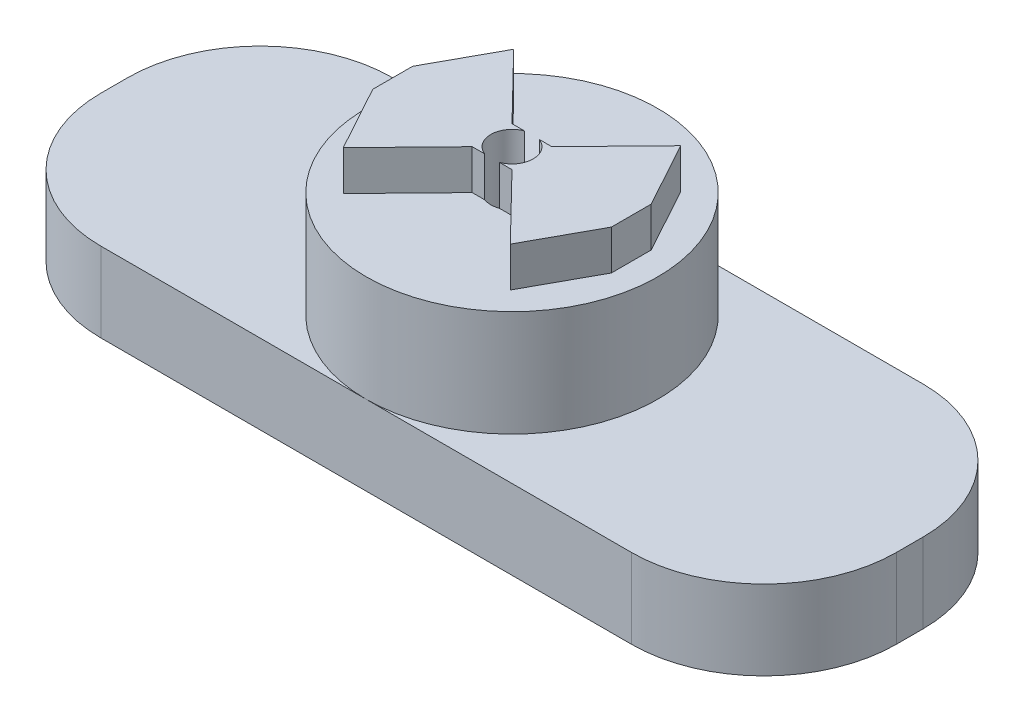
ISO-10303-21;
HEADER;
FILE_DESCRIPTION(('STEP AP214'),'2;1');
FILE_NAME('part.step','',(''),(''),'','','');
FILE_SCHEMA(('AUTOMOTIVE_DESIGN { 1 0 10303 214 1 1 1 1 }'));
ENDSEC;
DATA;
#1=APPLICATION_CONTEXT('core data for automotive mechanical design processes');
#2=APPLICATION_PROTOCOL_DEFINITION('international standard','automotive_design',2000,#1);
#3=PRODUCT_CONTEXT('',#1,'mechanical');
#4=PRODUCT('Part','Part','',(#3));
#5=PRODUCT_RELATED_PRODUCT_CATEGORY('part','',(#4));
#6=PRODUCT_DEFINITION_FORMATION('','',#4);
#7=PRODUCT_DEFINITION_CONTEXT('part definition',#1,'design');
#8=PRODUCT_DEFINITION('design','',#6,#7);
#9=PRODUCT_DEFINITION_SHAPE('','',#8);
#10=(LENGTH_UNIT() NAMED_UNIT(*) SI_UNIT(.MILLI.,.METRE.));
#11=(NAMED_UNIT(*) PLANE_ANGLE_UNIT() SI_UNIT($,.RADIAN.));
#12=(NAMED_UNIT(*) SI_UNIT($,.STERADIAN.) SOLID_ANGLE_UNIT());
#13=UNCERTAINTY_MEASURE_WITH_UNIT(LENGTH_MEASURE(1.E-05),#10,'distance_accuracy_value','');
#14=(GEOMETRIC_REPRESENTATION_CONTEXT(3) GLOBAL_UNCERTAINTY_ASSIGNED_CONTEXT((#13)) GLOBAL_UNIT_ASSIGNED_CONTEXT((#10,
#11,#12)) REPRESENTATION_CONTEXT('',''));
#15=CARTESIAN_POINT('',(0.,0.,0.));
#16=DIRECTION('',(0.,0.,1.));
#17=DIRECTION('',(1.,0.,0.));
#18=AXIS2_PLACEMENT_3D('',#15,#16,#17);
#19=CARTESIAN_POINT('',(1.5,17.,-1.5));
#20=DIRECTION('',(0.,0.,1.));
#21=DIRECTION('',(1.,0.,0.));
#22=AXIS2_PLACEMENT_3D('',#19,#20,#21);
#23=PLANE('',#22);
#24=DIRECTION('',(-1.,0.,0.));
#25=VECTOR('',#24,1.);
#26=CARTESIAN_POINT('',(1.5,17.,-1.5));
#27=LINE('',#26,#25);
#28=CARTESIAN_POINT('',(-0.556776436282992,17.,-1.5));
#29=VERTEX_POINT('',#28);
#30=CARTESIAN_POINT('',(-1.5,17.,-1.5));
#31=VERTEX_POINT('',#30);
#32=EDGE_CURVE('E373',#29,#31,#27,.T.);
#33=ORIENTED_EDGE('',*,*,#32,.F.);
#34=DIRECTION('',(0.,-1.,0.));
#35=VECTOR('',#34,1.);
#36=CARTESIAN_POINT('',(-0.556776436282994,4.,-1.5));
#37=LINE('',#36,#35);
#38=CARTESIAN_POINT('',(-0.556776436282994,14.,-1.5));
#39=VERTEX_POINT('',#38);
#40=EDGE_CURVE('E71',#29,#39,#37,.T.);
#41=ORIENTED_EDGE('',*,*,#40,.T.);
#42=DIRECTION('',(-1.,0.,0.));
#43=VECTOR('',#42,1.);
#44=CARTESIAN_POINT('',(1.5,14.,-1.5));
#45=LINE('',#44,#43);
#46=CARTESIAN_POINT('',(-1.5,14.,-1.5));
#47=VERTEX_POINT('',#46);
#48=EDGE_CURVE('E367',#39,#47,#45,.T.);
#49=ORIENTED_EDGE('',*,*,#48,.T.);
#50=DIRECTION('',(0.,-1.,0.));
#51=VECTOR('',#50,1.);
#52=CARTESIAN_POINT('',(-1.5,17.,-1.5));
#53=LINE('',#52,#51);
#54=EDGE_CURVE('E501',#31,#47,#53,.T.);
#55=ORIENTED_EDGE('',*,*,#54,.F.);
#56=EDGE_LOOP('',(#33,#41,#49,#55));
#57=FACE_BOUND('',#56,.T.);
#58=ADVANCED_FACE('F44',(#57),#23,.F.);
#59=CARTESIAN_POINT('',(-1.5,17.,1.5));
#60=DIRECTION('',(0.,0.,-1.));
#61=DIRECTION('',(-1.,0.,0.));
#62=AXIS2_PLACEMENT_3D('',#59,#60,#61);
#63=PLANE('',#62);
#64=DIRECTION('',(1.,0.,0.));
#65=VECTOR('',#64,1.);
#66=CARTESIAN_POINT('',(-1.5,17.,1.5));
#67=LINE('',#66,#65);
#68=CARTESIAN_POINT('',(0.556776436282994,17.,1.5));
#69=VERTEX_POINT('',#68);
#70=CARTESIAN_POINT('',(1.5,17.,1.5));
#71=VERTEX_POINT('',#70);
#72=EDGE_CURVE('E388',#69,#71,#67,.T.);
#73=ORIENTED_EDGE('',*,*,#72,.F.);
#74=DIRECTION('',(0.,-1.,0.));
#75=VECTOR('',#74,1.);
#76=CARTESIAN_POINT('',(0.556776436282996,4.,1.5));
#77=LINE('',#76,#75);
#78=CARTESIAN_POINT('',(0.556776436282996,14.,1.5));
#79=VERTEX_POINT('',#78);
#80=EDGE_CURVE('E357',#69,#79,#77,.T.);
#81=ORIENTED_EDGE('',*,*,#80,.T.);
#82=DIRECTION('',(1.,0.,0.));
#83=VECTOR('',#82,1.);
#84=CARTESIAN_POINT('',(-1.5,14.,1.5));
#85=LINE('',#84,#83);
#86=CARTESIAN_POINT('',(1.5,14.,1.5));
#87=VERTEX_POINT('',#86);
#88=EDGE_CURVE('E433',#79,#87,#85,.T.);
#89=ORIENTED_EDGE('',*,*,#88,.T.);
#90=DIRECTION('',(0.,-1.,0.));
#91=VECTOR('',#90,1.);
#92=CARTESIAN_POINT('',(1.5,17.,1.5));
#93=LINE('',#92,#91);
#94=EDGE_CURVE('E477',#71,#87,#93,.T.);
#95=ORIENTED_EDGE('',*,*,#94,.F.);
#96=EDGE_LOOP('',(#73,#81,#89,#95));
#97=FACE_BOUND('',#96,.T.);
#98=ADVANCED_FACE('F704',(#97),#63,.F.);
#99=CARTESIAN_POINT('',(0.,17.,0.));
#100=DIRECTION('',(0.,1.,0.));
#101=DIRECTION('',(0.,0.,1.));
#102=AXIS2_PLACEMENT_3D('',#99,#100,#101);
#103=PLANE('',#102);
#104=CARTESIAN_POINT('',(1.5,17.,-1.5));
#105=VERTEX_POINT('',#104);
#106=CARTESIAN_POINT('',(0.556776436282992,17.,-1.5));
#107=VERTEX_POINT('',#106);
#108=EDGE_CURVE('E368',#105,#107,#27,.T.);
#109=ORIENTED_EDGE('',*,*,#108,.T.);
#110=CARTESIAN_POINT('',(0.,17.,0.));
#111=DIRECTION('',(0.,-1.,0.));
#112=DIRECTION('',(0.,0.,-1.));
#113=AXIS2_PLACEMENT_3D('',#110,#111,#112);
#114=CIRCLE('',#113,1.6);
#115=EDGE_CURVE('E56',#107,#69,#114,.T.);
#116=ORIENTED_EDGE('',*,*,#115,.T.);
#117=ORIENTED_EDGE('',*,*,#72,.T.);
#118=DIRECTION('',(0.697851646705174,0.,0.716242332727462));
#119=VECTOR('',#118,1.);
#120=CARTESIAN_POINT('',(1.5,17.,1.5));
#121=LINE('',#120,#119);
#122=CARTESIAN_POINT('',(6.30039359887258,17.,6.42689975799261));
#123=VERTEX_POINT('',#122);
#124=EDGE_CURVE('E393',#71,#123,#121,.T.);
#125=ORIENTED_EDGE('',*,*,#124,.T.);
#126=DIRECTION('',(0.480525794873226,0.,-0.876980592978804));
#127=VECTOR('',#126,1.);
#128=CARTESIAN_POINT('',(6.30039359887258,17.,6.42689975799261));
#129=LINE('',#128,#127);
#130=CARTESIAN_POINT('',(9.,17.,1.5));
#131=VERTEX_POINT('',#130);
#132=EDGE_CURVE('E396',#123,#131,#129,.T.);
#133=ORIENTED_EDGE('',*,*,#132,.T.);
#134=DIRECTION('',(0.,0.,-1.));
#135=VECTOR('',#134,1.);
#136=CARTESIAN_POINT('',(9.,17.,1.5));
#137=LINE('',#136,#135);
#138=CARTESIAN_POINT('',(9.,17.,-1.5));
#139=VERTEX_POINT('',#138);
#140=EDGE_CURVE('E399',#131,#139,#137,.T.);
#141=ORIENTED_EDGE('',*,*,#140,.T.);
#142=DIRECTION('',(-0.480525794873226,0.,-0.876980592978804));
#143=VECTOR('',#142,1.);
#144=CARTESIAN_POINT('',(9.,17.,-1.5));
#145=LINE('',#144,#143);
#146=CARTESIAN_POINT('',(6.30039359887258,17.,-6.42689975799261));
#147=VERTEX_POINT('',#146);
#148=EDGE_CURVE('E402',#139,#147,#145,.T.);
#149=ORIENTED_EDGE('',*,*,#148,.T.);
#150=DIRECTION('',(-0.697851646705175,0.,0.716242332727462));
#151=VECTOR('',#150,1.);
#152=CARTESIAN_POINT('',(6.30039359887258,17.,-6.42689975799261));
#153=LINE('',#152,#151);
#154=EDGE_CURVE('E405',#147,#105,#153,.T.);
#155=ORIENTED_EDGE('',*,*,#154,.T.);
#156=EDGE_LOOP('',(#109,#116,#117,#125,#133,#141,#149,#155));
#157=FACE_BOUND('',#156,.T.);
#158=ADVANCED_FACE('F710',(#157),#103,.T.);
#159=CARTESIAN_POINT('',(-1.5,17.,1.5));
#160=VERTEX_POINT('',#159);
#161=CARTESIAN_POINT('',(-0.556776436282994,17.,1.5));
#162=VERTEX_POINT('',#161);
#163=EDGE_CURVE('E389',#160,#162,#67,.T.);
#164=ORIENTED_EDGE('',*,*,#163,.T.);
#165=EDGE_CURVE('E11',#162,#29,#114,.T.);
#166=ORIENTED_EDGE('',*,*,#165,.T.);
#167=ORIENTED_EDGE('',*,*,#32,.T.);
#168=DIRECTION('',(-0.697851646705174,0.,-0.716242332727462));
#169=VECTOR('',#168,1.);
#170=CARTESIAN_POINT('',(-1.5,17.,-1.5));
#171=LINE('',#170,#169);
#172=CARTESIAN_POINT('',(-6.30039359887257,17.,-6.42689975799261));
#173=VERTEX_POINT('',#172);
#174=EDGE_CURVE('E372',#31,#173,#171,.T.);
#175=ORIENTED_EDGE('',*,*,#174,.T.);
#176=DIRECTION('',(-0.480525794873226,0.,0.876980592978804));
#177=VECTOR('',#176,1.);
#178=CARTESIAN_POINT('',(-6.30039359887257,17.,-6.42689975799261));
#179=LINE('',#178,#177);
#180=CARTESIAN_POINT('',(-9.,17.,-1.5));
#181=VERTEX_POINT('',#180);
#182=EDGE_CURVE('E376',#173,#181,#179,.T.);
#183=ORIENTED_EDGE('',*,*,#182,.T.);
#184=DIRECTION('',(0.,0.,1.));
#185=VECTOR('',#184,1.);
#186=CARTESIAN_POINT('',(-9.,17.,-1.5));
#187=LINE('',#186,#185);
#188=CARTESIAN_POINT('',(-9.,17.,1.5));
#189=VERTEX_POINT('',#188);
#190=EDGE_CURVE('E379',#181,#189,#187,.T.);
#191=ORIENTED_EDGE('',*,*,#190,.T.);
#192=DIRECTION('',(0.480525794873226,0.,0.876980592978804));
#193=VECTOR('',#192,1.);
#194=CARTESIAN_POINT('',(-9.,17.,1.5));
#195=LINE('',#194,#193);
#196=CARTESIAN_POINT('',(-6.30039359887257,17.,6.42689975799261));
#197=VERTEX_POINT('',#196);
#198=EDGE_CURVE('E382',#189,#197,#195,.T.);
#199=ORIENTED_EDGE('',*,*,#198,.T.);
#200=DIRECTION('',(0.697851646705174,0.,-0.716242332727462));
#201=VECTOR('',#200,1.);
#202=CARTESIAN_POINT('',(-6.30039359887257,17.,6.42689975799261));
#203=LINE('',#202,#201);
#204=EDGE_CURVE('E385',#197,#160,#203,.T.);
#205=ORIENTED_EDGE('',*,*,#204,.T.);
#206=EDGE_LOOP('',(#164,#166,#167,#175,#183,#191,#199,#205));
#207=FACE_BOUND('',#206,.T.);
#208=ADVANCED_FACE('F673',(#207),#103,.T.);
#209=CARTESIAN_POINT('',(-20.01,6.,1.01));
#210=DIRECTION('',(0.,-1.,0.));
#211=DIRECTION('',(0.,0.,-1.));
#212=AXIS2_PLACEMENT_3D('',#209,#210,#211);
#213=PLANE('',#212);
#214=CARTESIAN_POINT('',(0.,6.,0.));
#215=DIRECTION('',(0.,1.,0.));
#216=DIRECTION('',(0.,0.,1.));
#217=AXIS2_PLACEMENT_3D('',#214,#215,#216);
#218=CIRCLE('',#217,11.);
#219=CARTESIAN_POINT('',(0.,6.,11.));
#220=VERTEX_POINT('',#219);
#221=CARTESIAN_POINT('',(0.,6.,-11.));
#222=VERTEX_POINT('',#221);
#223=EDGE_CURVE('E510',#220,#222,#218,.T.);
#224=ORIENTED_EDGE('',*,*,#223,.F.);
#225=DIRECTION('',(1.,0.,0.));
#226=VECTOR('',#225,1.);
#227=CARTESIAN_POINT('',(-20.01,6.,11.));
#228=LINE('',#227,#226);
#229=CARTESIAN_POINT('',(20.01,6.,11.));
#230=VERTEX_POINT('',#229);
#231=EDGE_CURVE('E526',#220,#230,#228,.T.);
#232=ORIENTED_EDGE('',*,*,#231,.T.);
#233=CARTESIAN_POINT('',(20.01,6.,1.01));
#234=DIRECTION('',(0.,1.,0.));
#235=DIRECTION('',(0.,0.,1.));
#236=AXIS2_PLACEMENT_3D('',#233,#234,#235);
#237=CIRCLE('',#236,9.99);
#238=CARTESIAN_POINT('',(30.,6.,1.01));
#239=VERTEX_POINT('',#238);
#240=EDGE_CURVE('E531',#230,#239,#237,.T.);
#241=ORIENTED_EDGE('',*,*,#240,.T.);
#242=DIRECTION('',(0.,0.,-1.));
#243=VECTOR('',#242,1.);
#244=CARTESIAN_POINT('',(30.,6.,1.01));
#245=LINE('',#244,#243);
#246=CARTESIAN_POINT('',(30.,6.,-1.01));
#247=VERTEX_POINT('',#246);
#248=EDGE_CURVE('E534',#239,#247,#245,.T.);
#249=ORIENTED_EDGE('',*,*,#248,.T.);
#250=CARTESIAN_POINT('',(20.01,6.,-1.01));
#251=DIRECTION('',(0.,1.,0.));
#252=DIRECTION('',(0.,0.,-1.));
#253=AXIS2_PLACEMENT_3D('',#250,#251,#252);
#254=CIRCLE('',#253,9.99);
#255=CARTESIAN_POINT('',(20.01,6.,-11.));
#256=VERTEX_POINT('',#255);
#257=EDGE_CURVE('E537',#247,#256,#254,.T.);
#258=ORIENTED_EDGE('',*,*,#257,.T.);
#259=DIRECTION('',(-1.,0.,0.));
#260=VECTOR('',#259,1.);
#261=CARTESIAN_POINT('',(-20.01,6.,-11.));
#262=LINE('',#261,#260);
#263=EDGE_CURVE('E541',#256,#222,#262,.T.);
#264=ORIENTED_EDGE('',*,*,#263,.T.);
#265=EDGE_LOOP('',(#224,#232,#241,#249,#258,#264));
#266=FACE_BOUND('',#265,.T.);
#267=ADVANCED_FACE('F624',(#266),#213,.F.);
#268=CARTESIAN_POINT('',(-20.01,6.,1.01));
#269=DIRECTION('',(0.,-1.,0.));
#270=DIRECTION('',(0.,0.,-1.));
#271=AXIS2_PLACEMENT_3D('',#268,#269,#270);
#272=CYLINDRICAL_SURFACE('',#271,9.99);
#273=CARTESIAN_POINT('',(-20.01,0.,1.01));
#274=DIRECTION('',(0.,1.,0.));
#275=DIRECTION('',(0.,0.,-1.));
#276=AXIS2_PLACEMENT_3D('',#273,#274,#275);
#277=CIRCLE('',#276,9.99);
#278=CARTESIAN_POINT('',(-30.,0.,1.01));
#279=VERTEX_POINT('',#278);
#280=CARTESIAN_POINT('',(-20.01,0.,11.));
#281=VERTEX_POINT('',#280);
#282=EDGE_CURVE('E518',#279,#281,#277,.T.);
#283=ORIENTED_EDGE('',*,*,#282,.T.);
#284=DIRECTION('',(0.,-1.,0.));
#285=VECTOR('',#284,1.);
#286=CARTESIAN_POINT('',(-20.01,6.,11.));
#287=LINE('',#286,#285);
#288=CARTESIAN_POINT('',(-20.01,6.,11.));
#289=VERTEX_POINT('',#288);
#290=EDGE_CURVE('E48',#289,#281,#287,.T.);
#291=ORIENTED_EDGE('',*,*,#290,.F.);
#292=CARTESIAN_POINT('',(-20.01,6.,1.01));
#293=DIRECTION('',(0.,1.,0.));
#294=DIRECTION('',(0.,0.,-1.));
#295=AXIS2_PLACEMENT_3D('',#292,#293,#294);
#296=CIRCLE('',#295,9.99);
#297=CARTESIAN_POINT('',(-30.,6.,1.01));
#298=VERTEX_POINT('',#297);
#299=EDGE_CURVE('E522',#298,#289,#296,.T.);
#300=ORIENTED_EDGE('',*,*,#299,.F.);
#301=DIRECTION('',(0.,-1.,0.));
#302=VECTOR('',#301,1.);
#303=CARTESIAN_POINT('',(-30.,6.,1.01));
#304=LINE('',#303,#302);
#305=EDGE_CURVE('E551',#298,#279,#304,.T.);
#306=ORIENTED_EDGE('',*,*,#305,.T.);
#307=EDGE_LOOP('',(#283,#291,#300,#306));
#308=FACE_BOUND('',#307,.T.);
#309=ADVANCED_FACE('F46',(#308),#272,.T.);
#310=CARTESIAN_POINT('',(-20.01,6.,11.));
#311=DIRECTION('',(0.,0.,-1.));
#312=DIRECTION('',(-1.,0.,0.));
#313=AXIS2_PLACEMENT_3D('',#310,#311,#312);
#314=PLANE('',#313);
#315=DIRECTION('',(1.,0.,0.));
#316=VECTOR('',#315,1.);
#317=CARTESIAN_POINT('',(-20.01,0.,11.));
#318=LINE('',#317,#316);
#319=CARTESIAN_POINT('',(20.01,0.,11.));
#320=VERTEX_POINT('',#319);
#321=EDGE_CURVE('E555',#281,#320,#318,.T.);
#322=ORIENTED_EDGE('',*,*,#321,.T.);
#323=DIRECTION('',(0.,-1.,0.));
#324=VECTOR('',#323,1.);
#325=CARTESIAN_POINT('',(20.01,6.,11.));
#326=LINE('',#325,#324);
#327=EDGE_CURVE('E597',#230,#320,#326,.T.);
#328=ORIENTED_EDGE('',*,*,#327,.F.);
#329=ORIENTED_EDGE('',*,*,#231,.F.);
#330=EDGE_CURVE('E528',#289,#220,#228,.T.);
#331=ORIENTED_EDGE('',*,*,#330,.F.);
#332=ORIENTED_EDGE('',*,*,#290,.T.);
#333=EDGE_LOOP('',(#322,#328,#329,#331,#332));
#334=FACE_BOUND('',#333,.T.);
#335=ADVANCED_FACE('F648',(#334),#314,.F.);
#336=CARTESIAN_POINT('',(20.01,6.,1.01));
#337=DIRECTION('',(0.,-1.,0.));
#338=DIRECTION('',(0.,0.,-1.));
#339=AXIS2_PLACEMENT_3D('',#336,#337,#338);
#340=CYLINDRICAL_SURFACE('',#339,9.99);
#341=CARTESIAN_POINT('',(20.01,0.,1.01));
#342=DIRECTION('',(0.,1.,0.));
#343=DIRECTION('',(0.,0.,1.));
#344=AXIS2_PLACEMENT_3D('',#341,#342,#343);
#345=CIRCLE('',#344,9.99);
#346=CARTESIAN_POINT('',(30.,0.,1.01));
#347=VERTEX_POINT('',#346);
#348=EDGE_CURVE('E558',#320,#347,#345,.T.);
#349=ORIENTED_EDGE('',*,*,#348,.T.);
#350=DIRECTION('',(0.,-1.,0.));
#351=VECTOR('',#350,1.);
#352=CARTESIAN_POINT('',(30.,6.,1.01));
#353=LINE('',#352,#351);
#354=EDGE_CURVE('E594',#239,#347,#353,.T.);
#355=ORIENTED_EDGE('',*,*,#354,.F.);
#356=ORIENTED_EDGE('',*,*,#240,.F.);
#357=ORIENTED_EDGE('',*,*,#327,.T.);
#358=EDGE_LOOP('',(#349,#355,#356,#357));
#359=FACE_BOUND('',#358,.T.);
#360=ADVANCED_FACE('F650',(#359),#340,.T.);
#361=CARTESIAN_POINT('',(30.,6.,1.01));
#362=DIRECTION('',(-1.,0.,0.));
#363=DIRECTION('',(0.,0.,1.));
#364=AXIS2_PLACEMENT_3D('',#361,#362,#363);
#365=PLANE('',#364);
#366=DIRECTION('',(0.,0.,-1.));
#367=VECTOR('',#366,1.);
#368=CARTESIAN_POINT('',(30.,0.,1.01));
#369=LINE('',#368,#367);
#370=CARTESIAN_POINT('',(30.,0.,-1.01));
#371=VERTEX_POINT('',#370);
#372=EDGE_CURVE('E561',#347,#371,#369,.T.);
#373=ORIENTED_EDGE('',*,*,#372,.T.);
#374=DIRECTION('',(0.,-1.,0.));
#375=VECTOR('',#374,1.);
#376=CARTESIAN_POINT('',(30.,6.,-1.01));
#377=LINE('',#376,#375);
#378=EDGE_CURVE('E590',#247,#371,#377,.T.);
#379=ORIENTED_EDGE('',*,*,#378,.F.);
#380=ORIENTED_EDGE('',*,*,#248,.F.);
#381=ORIENTED_EDGE('',*,*,#354,.T.);
#382=EDGE_LOOP('',(#373,#379,#380,#381));
#383=FACE_BOUND('',#382,.T.);
#384=ADVANCED_FACE('F952',(#383),#365,.F.);
#385=CARTESIAN_POINT('',(20.01,6.,-1.01));
#386=DIRECTION('',(0.,-1.,0.));
#387=DIRECTION('',(0.,0.,-1.));
#388=AXIS2_PLACEMENT_3D('',#385,#386,#387);
#389=CYLINDRICAL_SURFACE('',#388,9.99);
#390=CARTESIAN_POINT('',(20.01,0.,-1.01));
#391=DIRECTION('',(0.,1.,0.));
#392=DIRECTION('',(0.,0.,-1.));
#393=AXIS2_PLACEMENT_3D('',#390,#391,#392);
#394=CIRCLE('',#393,9.99);
#395=CARTESIAN_POINT('',(20.01,0.,-11.));
#396=VERTEX_POINT('',#395);
#397=EDGE_CURVE('E564',#371,#396,#394,.T.);
#398=ORIENTED_EDGE('',*,*,#397,.T.);
#399=DIRECTION('',(0.,-1.,0.));
#400=VECTOR('',#399,1.);
#401=CARTESIAN_POINT('',(20.01,6.,-11.));
#402=LINE('',#401,#400);
#403=EDGE_CURVE('E586',#256,#396,#402,.T.);
#404=ORIENTED_EDGE('',*,*,#403,.F.);
#405=ORIENTED_EDGE('',*,*,#257,.F.);
#406=ORIENTED_EDGE('',*,*,#378,.T.);
#407=EDGE_LOOP('',(#398,#404,#405,#406));
#408=FACE_BOUND('',#407,.T.);
#409=ADVANCED_FACE('F630',(#408),#389,.T.);
#410=CARTESIAN_POINT('',(-20.01,6.,-11.));
#411=DIRECTION('',(0.,0.,1.));
#412=DIRECTION('',(1.,0.,0.));
#413=AXIS2_PLACEMENT_3D('',#410,#411,#412);
#414=PLANE('',#413);
#415=DIRECTION('',(-1.,0.,0.));
#416=VECTOR('',#415,1.);
#417=CARTESIAN_POINT('',(-20.01,0.,-11.));
#418=LINE('',#417,#416);
#419=CARTESIAN_POINT('',(-20.01,0.,-11.));
#420=VERTEX_POINT('',#419);
#421=EDGE_CURVE('E567',#396,#420,#418,.T.);
#422=ORIENTED_EDGE('',*,*,#421,.T.);
#423=DIRECTION('',(0.,-1.,0.));
#424=VECTOR('',#423,1.);
#425=CARTESIAN_POINT('',(-20.01,6.,-11.));
#426=LINE('',#425,#424);
#427=CARTESIAN_POINT('',(-20.01,6.,-11.));
#428=VERTEX_POINT('',#427);
#429=EDGE_CURVE('E582',#428,#420,#426,.T.);
#430=ORIENTED_EDGE('',*,*,#429,.F.);
#431=EDGE_CURVE('E540',#222,#428,#262,.T.);
#432=ORIENTED_EDGE('',*,*,#431,.F.);
#433=ORIENTED_EDGE('',*,*,#263,.F.);
#434=ORIENTED_EDGE('',*,*,#403,.T.);
#435=EDGE_LOOP('',(#422,#430,#432,#433,#434));
#436=FACE_BOUND('',#435,.T.);
#437=ADVANCED_FACE('F620',(#436),#414,.F.);
#438=CARTESIAN_POINT('',(-20.01,6.,-1.01));
#439=DIRECTION('',(0.,-1.,0.));
#440=DIRECTION('',(0.,0.,-1.));
#441=AXIS2_PLACEMENT_3D('',#438,#439,#440);
#442=CYLINDRICAL_SURFACE('',#441,9.99);
#443=CARTESIAN_POINT('',(-20.01,0.,-1.01));
#444=DIRECTION('',(0.,1.,0.));
#445=DIRECTION('',(0.,0.,-1.));
#446=AXIS2_PLACEMENT_3D('',#443,#444,#445);
#447=CIRCLE('',#446,9.99);
#448=CARTESIAN_POINT('',(-30.,0.,-1.01));
#449=VERTEX_POINT('',#448);
#450=EDGE_CURVE('E570',#420,#449,#447,.T.);
#451=ORIENTED_EDGE('',*,*,#450,.T.);
#452=DIRECTION('',(0.,-1.,0.));
#453=VECTOR('',#452,1.);
#454=CARTESIAN_POINT('',(-30.,6.,-1.01));
#455=LINE('',#454,#453);
#456=CARTESIAN_POINT('',(-30.,6.,-1.01));
#457=VERTEX_POINT('',#456);
#458=EDGE_CURVE('E578',#457,#449,#455,.T.);
#459=ORIENTED_EDGE('',*,*,#458,.F.);
#460=CARTESIAN_POINT('',(-20.01,6.,-1.01));
#461=DIRECTION('',(0.,1.,0.));
#462=DIRECTION('',(0.,0.,-1.));
#463=AXIS2_PLACEMENT_3D('',#460,#461,#462);
#464=CIRCLE('',#463,9.99);
#465=EDGE_CURVE('E545',#428,#457,#464,.T.);
#466=ORIENTED_EDGE('',*,*,#465,.F.);
#467=ORIENTED_EDGE('',*,*,#429,.T.);
#468=EDGE_LOOP('',(#451,#459,#466,#467));
#469=FACE_BOUND('',#468,.T.);
#470=ADVANCED_FACE('F641',(#469),#442,.T.);
#471=CARTESIAN_POINT('',(-30.,6.,1.01));
#472=DIRECTION('',(1.,0.,0.));
#473=DIRECTION('',(0.,0.,-1.));
#474=AXIS2_PLACEMENT_3D('',#471,#472,#473);
#475=PLANE('',#474);
#476=DIRECTION('',(0.,0.,1.));
#477=VECTOR('',#476,1.);
#478=CARTESIAN_POINT('',(-30.,0.,1.01));
#479=LINE('',#478,#477);
#480=EDGE_CURVE('E527',#449,#279,#479,.T.);
#481=ORIENTED_EDGE('',*,*,#480,.T.);
#482=ORIENTED_EDGE('',*,*,#305,.F.);
#483=DIRECTION('',(0.,0.,1.));
#484=VECTOR('',#483,1.);
#485=CARTESIAN_POINT('',(-30.,6.,1.01));
#486=LINE('',#485,#484);
#487=EDGE_CURVE('E548',#457,#298,#486,.T.);
#488=ORIENTED_EDGE('',*,*,#487,.F.);
#489=ORIENTED_EDGE('',*,*,#458,.T.);
#490=EDGE_LOOP('',(#481,#482,#488,#489));
#491=FACE_BOUND('',#490,.T.);
#492=ADVANCED_FACE('F644',(#491),#475,.F.);
#493=EDGE_CURVE('E54',#222,#220,#218,.T.);
#494=ORIENTED_EDGE('',*,*,#493,.F.);
#495=ORIENTED_EDGE('',*,*,#431,.T.);
#496=ORIENTED_EDGE('',*,*,#465,.T.);
#497=ORIENTED_EDGE('',*,*,#487,.T.);
#498=ORIENTED_EDGE('',*,*,#299,.T.);
#499=ORIENTED_EDGE('',*,*,#330,.T.);
#500=EDGE_LOOP('',(#494,#495,#496,#497,#498,#499));
#501=FACE_BOUND('',#500,.T.);
#502=ADVANCED_FACE('F615',(#501),#213,.F.);
#503=CARTESIAN_POINT('',(-20.01,0.,1.01));
#504=DIRECTION('',(0.,-1.,0.));
#505=DIRECTION('',(0.,0.,-1.));
#506=AXIS2_PLACEMENT_3D('',#503,#504,#505);
#507=PLANE('',#506);
#508=DIRECTION('',(1.,0.,0.));
#509=VECTOR('',#508,1.);
#510=CARTESIAN_POINT('',(10.,0.,-2.5));
#511=LINE('',#510,#509);
#512=CARTESIAN_POINT('',(10.,0.,-2.5));
#513=VERTEX_POINT('',#512);
#514=CARTESIAN_POINT('',(20.,0.,-2.5));
#515=VERTEX_POINT('',#514);
#516=EDGE_CURVE('E63',#513,#515,#511,.T.);
#517=ORIENTED_EDGE('',*,*,#516,.F.);
#518=DIRECTION('',(0.,0.,-1.));
#519=VECTOR('',#518,1.);
#520=CARTESIAN_POINT('',(10.,0.,2.5));
#521=LINE('',#520,#519);
#522=CARTESIAN_POINT('',(10.,0.,2.5));
#523=VERTEX_POINT('',#522);
#524=EDGE_CURVE('E280',#523,#513,#521,.T.);
#525=ORIENTED_EDGE('',*,*,#524,.F.);
#526=DIRECTION('',(-1.,0.,0.));
#527=VECTOR('',#526,1.);
#528=CARTESIAN_POINT('',(10.,0.,2.5));
#529=LINE('',#528,#527);
#530=CARTESIAN_POINT('',(20.,0.,2.5));
#531=VERTEX_POINT('',#530);
#532=EDGE_CURVE('E284',#531,#523,#529,.T.);
#533=ORIENTED_EDGE('',*,*,#532,.F.);
#534=DIRECTION('',(0.,0.,-1.));
#535=VECTOR('',#534,1.);
#536=CARTESIAN_POINT('',(20.,0.,2.5));
#537=LINE('',#536,#535);
#538=CARTESIAN_POINT('',(20.,0.,6.));
#539=VERTEX_POINT('',#538);
#540=EDGE_CURVE('E315',#539,#531,#537,.T.);
#541=ORIENTED_EDGE('',*,*,#540,.F.);
#542=DIRECTION('',(-0.707106781186547,0.,0.707106781186548));
#543=VECTOR('',#542,1.);
#544=CARTESIAN_POINT('',(20.,0.,6.));
#545=LINE('',#544,#543);
#546=CARTESIAN_POINT('',(26.,0.,0.));
#547=VERTEX_POINT('',#546);
#548=EDGE_CURVE('E311',#547,#539,#545,.T.);
#549=ORIENTED_EDGE('',*,*,#548,.F.);
#550=DIRECTION('',(0.707106781186548,0.,0.707106781186547));
#551=VECTOR('',#550,1.);
#552=CARTESIAN_POINT('',(26.,0.,0.));
#553=LINE('',#552,#551);
#554=CARTESIAN_POINT('',(20.,0.,-6.));
#555=VERTEX_POINT('',#554);
#556=EDGE_CURVE('E307',#555,#547,#553,.T.);
#557=ORIENTED_EDGE('',*,*,#556,.F.);
#558=DIRECTION('',(0.,0.,-1.));
#559=VECTOR('',#558,1.);
#560=CARTESIAN_POINT('',(20.,0.,-2.5));
#561=LINE('',#560,#559);
#562=EDGE_CURVE('E304',#515,#555,#561,.T.);
#563=ORIENTED_EDGE('',*,*,#562,.F.);
#564=EDGE_LOOP('',(#517,#525,#533,#541,#549,#557,#563));
#565=FACE_BOUND('',#564,.T.);
#566=CARTESIAN_POINT('',(0.,0.,0.));
#567=DIRECTION('',(0.,-1.,0.));
#568=DIRECTION('',(0.,0.,-1.));
#569=AXIS2_PLACEMENT_3D('',#566,#567,#568);
#570=CIRCLE('',#569,6.);
#571=CARTESIAN_POINT('',(0.,0.,-6.));
#572=VERTEX_POINT('',#571);
#573=EDGE_CURVE('E505',#572,#572,#570,.T.);
#574=ORIENTED_EDGE('',*,*,#573,.F.);
#575=EDGE_LOOP('',(#574));
#576=FACE_BOUND('',#575,.T.);
#577=ORIENTED_EDGE('',*,*,#282,.F.);
#578=ORIENTED_EDGE('',*,*,#480,.F.);
#579=ORIENTED_EDGE('',*,*,#450,.F.);
#580=ORIENTED_EDGE('',*,*,#421,.F.);
#581=ORIENTED_EDGE('',*,*,#397,.F.);
#582=ORIENTED_EDGE('',*,*,#372,.F.);
#583=ORIENTED_EDGE('',*,*,#348,.F.);
#584=ORIENTED_EDGE('',*,*,#321,.F.);
#585=EDGE_LOOP('',(#577,#578,#579,#580,#581,#582,#583,#584));
#586=FACE_BOUND('',#585,.T.);
#587=ADVANCED_FACE('F636',(#565,#576,#586),#507,.T.);
#588=CARTESIAN_POINT('',(0.,14.,0.));
#589=DIRECTION('',(0.,-1.,0.));
#590=DIRECTION('',(0.,0.,-1.));
#591=AXIS2_PLACEMENT_3D('',#588,#589,#590);
#592=CYLINDRICAL_SURFACE('',#591,11.);
#593=CARTESIAN_POINT('',(0.,14.,0.));
#594=DIRECTION('',(0.,1.,0.));
#595=DIRECTION('',(0.,0.,1.));
#596=AXIS2_PLACEMENT_3D('',#593,#594,#595);
#597=CIRCLE('',#596,11.);
#598=CARTESIAN_POINT('',(0.,14.,11.));
#599=VERTEX_POINT('',#598);
#600=EDGE_CURVE('E514',#599,#599,#597,.T.);
#601=ORIENTED_EDGE('',*,*,#600,.F.);
#602=EDGE_LOOP('',(#601));
#603=FACE_BOUND('',#602,.T.);
#604=ORIENTED_EDGE('',*,*,#223,.T.);
#605=ORIENTED_EDGE('',*,*,#493,.T.);
#606=EDGE_LOOP('',(#604,#605));
#607=FACE_BOUND('',#606,.T.);
#608=ADVANCED_FACE('F611',(#603,#607),#592,.T.);
#609=CARTESIAN_POINT('',(0.,14.,0.));
#610=DIRECTION('',(0.,1.,0.));
#611=DIRECTION('',(0.,0.,1.));
#612=AXIS2_PLACEMENT_3D('',#609,#610,#611);
#613=PLANE('',#612);
#614=CARTESIAN_POINT('',(0.,14.,0.));
#615=DIRECTION('',(0.,1.,0.));
#616=DIRECTION('',(0.,0.,1.));
#617=AXIS2_PLACEMENT_3D('',#614,#615,#616);
#618=CIRCLE('',#617,1.6);
#619=CARTESIAN_POINT('',(0.556776436282994,14.,-1.5));
#620=VERTEX_POINT('',#619);
#621=EDGE_CURVE('E353',#620,#39,#618,.T.);
#622=ORIENTED_EDGE('',*,*,#621,.F.);
#623=CARTESIAN_POINT('',(1.5,14.,-1.5));
#624=VERTEX_POINT('',#623);
#625=EDGE_CURVE('E409',#624,#620,#45,.T.);
#626=ORIENTED_EDGE('',*,*,#625,.F.);
#627=DIRECTION('',(-0.697851646705175,0.,0.716242332727462));
#628=VECTOR('',#627,1.);
#629=CARTESIAN_POINT('',(6.30039359887258,14.,-6.42689975799261));
#630=LINE('',#629,#628);
#631=CARTESIAN_POINT('',(6.30039359887258,14.,-6.42689975799261));
#632=VERTEX_POINT('',#631);
#633=EDGE_CURVE('E454',#632,#624,#630,.T.);
#634=ORIENTED_EDGE('',*,*,#633,.F.);
#635=DIRECTION('',(-0.480525794873226,0.,-0.876980592978804));
#636=VECTOR('',#635,1.);
#637=CARTESIAN_POINT('',(9.,14.,-1.5));
#638=LINE('',#637,#636);
#639=CARTESIAN_POINT('',(9.,14.,-1.5));
#640=VERTEX_POINT('',#639);
#641=EDGE_CURVE('E450',#640,#632,#638,.T.);
#642=ORIENTED_EDGE('',*,*,#641,.F.);
#643=DIRECTION('',(0.,0.,-1.));
#644=VECTOR('',#643,1.);
#645=CARTESIAN_POINT('',(9.,14.,1.5));
#646=LINE('',#645,#644);
#647=CARTESIAN_POINT('',(9.,14.,1.5));
#648=VERTEX_POINT('',#647);
#649=EDGE_CURVE('E446',#648,#640,#646,.T.);
#650=ORIENTED_EDGE('',*,*,#649,.F.);
#651=DIRECTION('',(0.480525794873226,0.,-0.876980592978804));
#652=VECTOR('',#651,1.);
#653=CARTESIAN_POINT('',(6.30039359887258,14.,6.42689975799261));
#654=LINE('',#653,#652);
#655=CARTESIAN_POINT('',(6.30039359887258,14.,6.42689975799261));
#656=VERTEX_POINT('',#655);
#657=EDGE_CURVE('E442',#656,#648,#654,.T.);
#658=ORIENTED_EDGE('',*,*,#657,.F.);
#659=DIRECTION('',(0.697851646705174,0.,0.716242332727462));
#660=VECTOR('',#659,1.);
#661=CARTESIAN_POINT('',(1.5,14.,1.5));
#662=LINE('',#661,#660);
#663=EDGE_CURVE('E438',#87,#656,#662,.T.);
#664=ORIENTED_EDGE('',*,*,#663,.F.);
#665=ORIENTED_EDGE('',*,*,#88,.F.);
#666=CARTESIAN_POINT('',(-0.556776436282996,14.,1.5));
#667=VERTEX_POINT('',#666);
#668=EDGE_CURVE('E349',#667,#79,#618,.T.);
#669=ORIENTED_EDGE('',*,*,#668,.F.);
#670=CARTESIAN_POINT('',(-1.5,14.,1.5));
#671=VERTEX_POINT('',#670);
#672=EDGE_CURVE('E434',#671,#667,#85,.T.);
#673=ORIENTED_EDGE('',*,*,#672,.F.);
#674=DIRECTION('',(0.697851646705174,0.,-0.716242332727462));
#675=VECTOR('',#674,1.);
#676=CARTESIAN_POINT('',(-6.30039359887257,14.,6.42689975799261));
#677=LINE('',#676,#675);
#678=CARTESIAN_POINT('',(-6.30039359887257,14.,6.42689975799261));
#679=VERTEX_POINT('',#678);
#680=EDGE_CURVE('E429',#679,#671,#677,.T.);
#681=ORIENTED_EDGE('',*,*,#680,.F.);
#682=DIRECTION('',(0.480525794873226,0.,0.876980592978804));
#683=VECTOR('',#682,1.);
#684=CARTESIAN_POINT('',(-9.,14.,1.5));
#685=LINE('',#684,#683);
#686=CARTESIAN_POINT('',(-9.,14.,1.5));
#687=VERTEX_POINT('',#686);
#688=EDGE_CURVE('E425',#687,#679,#685,.T.);
#689=ORIENTED_EDGE('',*,*,#688,.F.);
#690=DIRECTION('',(0.,0.,1.));
#691=VECTOR('',#690,1.);
#692=CARTESIAN_POINT('',(-9.,14.,-1.5));
#693=LINE('',#692,#691);
#694=CARTESIAN_POINT('',(-9.,14.,-1.5));
#695=VERTEX_POINT('',#694);
#696=EDGE_CURVE('E421',#695,#687,#693,.T.);
#697=ORIENTED_EDGE('',*,*,#696,.F.);
#698=DIRECTION('',(-0.480525794873226,0.,0.876980592978804));
#699=VECTOR('',#698,1.);
#700=CARTESIAN_POINT('',(-6.30039359887257,14.,-6.42689975799261));
#701=LINE('',#700,#699);
#702=CARTESIAN_POINT('',(-6.30039359887257,14.,-6.42689975799261));
#703=VERTEX_POINT('',#702);
#704=EDGE_CURVE('E417',#703,#695,#701,.T.);
#705=ORIENTED_EDGE('',*,*,#704,.F.);
#706=DIRECTION('',(-0.697851646705174,0.,-0.716242332727462));
#707=VECTOR('',#706,1.);
#708=CARTESIAN_POINT('',(-1.5,14.,-1.5));
#709=LINE('',#708,#707);
#710=EDGE_CURVE('E413',#47,#703,#709,.T.);
#711=ORIENTED_EDGE('',*,*,#710,.F.);
#712=ORIENTED_EDGE('',*,*,#48,.F.);
#713=EDGE_LOOP('',(#622,#626,#634,#642,#650,#658,#664,#665,#669,#673,#681,#689,#697,#705,#711,#712));
#714=FACE_BOUND('',#713,.T.);
#715=ORIENTED_EDGE('',*,*,#600,.T.);
#716=EDGE_LOOP('',(#715));
#717=FACE_BOUND('',#716,.T.);
#718=ADVANCED_FACE('F665',(#714,#717),#613,.T.);
#719=CARTESIAN_POINT('',(0.,4.,0.));
#720=DIRECTION('',(0.,-1.,0.));
#721=DIRECTION('',(0.,0.,-1.));
#722=AXIS2_PLACEMENT_3D('',#719,#720,#721);
#723=CYLINDRICAL_SURFACE('',#722,6.);
#724=CARTESIAN_POINT('',(0.,4.,0.));
#725=DIRECTION('',(0.,-1.,0.));
#726=DIRECTION('',(0.,0.,-1.));
#727=AXIS2_PLACEMENT_3D('',#724,#725,#726);
#728=CIRCLE('',#727,6.);
#729=CARTESIAN_POINT('',(0.,4.,-6.));
#730=VERTEX_POINT('',#729);
#731=EDGE_CURVE('E506',#730,#730,#728,.T.);
#732=ORIENTED_EDGE('',*,*,#731,.F.);
#733=EDGE_LOOP('',(#732));
#734=FACE_BOUND('',#733,.T.);
#735=ORIENTED_EDGE('',*,*,#573,.T.);
#736=EDGE_LOOP('',(#735));
#737=FACE_BOUND('',#736,.T.);
#738=ADVANCED_FACE('F721',(#734,#737),#723,.F.);
#739=CARTESIAN_POINT('',(0.,4.,0.));
#740=DIRECTION('',(0.,-1.,0.));
#741=DIRECTION('',(0.,0.,-1.));
#742=AXIS2_PLACEMENT_3D('',#739,#740,#741);
#743=PLANE('',#742);
#744=CARTESIAN_POINT('',(0.,4.,0.));
#745=DIRECTION('',(0.,-1.,0.));
#746=DIRECTION('',(0.,0.,-1.));
#747=AXIS2_PLACEMENT_3D('',#744,#745,#746);
#748=CIRCLE('',#747,3.15);
#749=CARTESIAN_POINT('',(0.,4.,-3.15));
#750=VERTEX_POINT('',#749);
#751=EDGE_CURVE('E325',#750,#750,#748,.T.);
#752=ORIENTED_EDGE('',*,*,#751,.F.);
#753=EDGE_LOOP('',(#752));
#754=FACE_BOUND('',#753,.T.);
#755=ORIENTED_EDGE('',*,*,#731,.T.);
#756=EDGE_LOOP('',(#755));
#757=FACE_BOUND('',#756,.T.);
#758=ADVANCED_FACE('F715',(#754,#757),#743,.T.);
#759=ORIENTED_EDGE('',*,*,#625,.T.);
#760=DIRECTION('',(0.,-1.,0.));
#761=VECTOR('',#760,1.);
#762=CARTESIAN_POINT('',(0.556776436282994,4.,-1.5));
#763=LINE('',#762,#761);
#764=EDGE_CURVE('E361',#620,#107,#763,.F.);
#765=ORIENTED_EDGE('',*,*,#764,.T.);
#766=ORIENTED_EDGE('',*,*,#108,.F.);
#767=DIRECTION('',(0.,-1.,0.));
#768=VECTOR('',#767,1.);
#769=CARTESIAN_POINT('',(1.5,17.,-1.5));
#770=LINE('',#769,#768);
#771=EDGE_CURVE('E408',#105,#624,#770,.T.);
#772=ORIENTED_EDGE('',*,*,#771,.T.);
#773=EDGE_LOOP('',(#759,#765,#766,#772));
#774=FACE_BOUND('',#773,.T.);
#775=ADVANCED_FACE('F701',(#774),#23,.F.);
#776=CARTESIAN_POINT('',(-1.5,17.,-1.5));
#777=DIRECTION('',(-0.716242332727462,0.,0.697851646705175));
#778=DIRECTION('',(0.697851646705175,0.,0.716242332727462));
#779=AXIS2_PLACEMENT_3D('',#776,#777,#778);
#780=PLANE('',#779);
#781=ORIENTED_EDGE('',*,*,#710,.T.);
#782=DIRECTION('',(0.,-1.,0.));
#783=VECTOR('',#782,1.);
#784=CARTESIAN_POINT('',(-6.30039359887257,17.,-6.42689975799261));
#785=LINE('',#784,#783);
#786=EDGE_CURVE('E497',#173,#703,#785,.T.);
#787=ORIENTED_EDGE('',*,*,#786,.F.);
#788=ORIENTED_EDGE('',*,*,#174,.F.);
#789=ORIENTED_EDGE('',*,*,#54,.T.);
#790=EDGE_LOOP('',(#781,#787,#788,#789));
#791=FACE_BOUND('',#790,.T.);
#792=ADVANCED_FACE('F670',(#791),#780,.F.);
#793=CARTESIAN_POINT('',(-6.30039359887257,17.,-6.42689975799261));
#794=DIRECTION('',(0.876980592978804,0.,0.480525794873226));
#795=DIRECTION('',(0.480525794873226,0.,-0.876980592978804));
#796=AXIS2_PLACEMENT_3D('',#793,#794,#795);
#797=PLANE('',#796);
#798=ORIENTED_EDGE('',*,*,#704,.T.);
#799=DIRECTION('',(0.,-1.,0.));
#800=VECTOR('',#799,1.);
#801=CARTESIAN_POINT('',(-9.,17.,-1.5));
#802=LINE('',#801,#800);
#803=EDGE_CURVE('E493',#181,#695,#802,.T.);
#804=ORIENTED_EDGE('',*,*,#803,.F.);
#805=ORIENTED_EDGE('',*,*,#182,.F.);
#806=ORIENTED_EDGE('',*,*,#786,.T.);
#807=EDGE_LOOP('',(#798,#804,#805,#806));
#808=FACE_BOUND('',#807,.T.);
#809=ADVANCED_FACE('F693',(#808),#797,.F.);
#810=CARTESIAN_POINT('',(-9.,17.,-1.5));
#811=DIRECTION('',(1.,0.,0.));
#812=DIRECTION('',(0.,0.,-1.));
#813=AXIS2_PLACEMENT_3D('',#810,#811,#812);
#814=PLANE('',#813);
#815=ORIENTED_EDGE('',*,*,#696,.T.);
#816=DIRECTION('',(0.,-1.,0.));
#817=VECTOR('',#816,1.);
#818=CARTESIAN_POINT('',(-9.,17.,1.5));
#819=LINE('',#818,#817);
#820=EDGE_CURVE('E489',#189,#687,#819,.T.);
#821=ORIENTED_EDGE('',*,*,#820,.F.);
#822=ORIENTED_EDGE('',*,*,#190,.F.);
#823=ORIENTED_EDGE('',*,*,#803,.T.);
#824=EDGE_LOOP('',(#815,#821,#822,#823));
#825=FACE_BOUND('',#824,.T.);
#826=ADVANCED_FACE('F690',(#825),#814,.F.);
#827=CARTESIAN_POINT('',(-9.,17.,1.5));
#828=DIRECTION('',(0.876980592978804,0.,-0.480525794873226));
#829=DIRECTION('',(-0.480525794873226,0.,-0.876980592978804));
#830=AXIS2_PLACEMENT_3D('',#827,#828,#829);
#831=PLANE('',#830);
#832=ORIENTED_EDGE('',*,*,#688,.T.);
#833=DIRECTION('',(0.,-1.,0.));
#834=VECTOR('',#833,1.);
#835=CARTESIAN_POINT('',(-6.30039359887257,17.,6.42689975799261));
#836=LINE('',#835,#834);
#837=EDGE_CURVE('E485',#197,#679,#836,.T.);
#838=ORIENTED_EDGE('',*,*,#837,.F.);
#839=ORIENTED_EDGE('',*,*,#198,.F.);
#840=ORIENTED_EDGE('',*,*,#820,.T.);
#841=EDGE_LOOP('',(#832,#838,#839,#840));
#842=FACE_BOUND('',#841,.T.);
#843=ADVANCED_FACE('F687',(#842),#831,.F.);
#844=CARTESIAN_POINT('',(-6.30039359887257,17.,6.42689975799261));
#845=DIRECTION('',(-0.716242332727462,0.,-0.697851646705174));
#846=DIRECTION('',(-0.697851646705174,0.,0.716242332727462));
#847=AXIS2_PLACEMENT_3D('',#844,#845,#846);
#848=PLANE('',#847);
#849=ORIENTED_EDGE('',*,*,#680,.T.);
#850=DIRECTION('',(0.,-1.,0.));
#851=VECTOR('',#850,1.);
#852=CARTESIAN_POINT('',(-1.5,17.,1.5));
#853=LINE('',#852,#851);
#854=EDGE_CURVE('E481',#160,#671,#853,.T.);
#855=ORIENTED_EDGE('',*,*,#854,.F.);
#856=ORIENTED_EDGE('',*,*,#204,.F.);
#857=ORIENTED_EDGE('',*,*,#837,.T.);
#858=EDGE_LOOP('',(#849,#855,#856,#857));
#859=FACE_BOUND('',#858,.T.);
#860=ADVANCED_FACE('F682',(#859),#848,.F.);
#861=ORIENTED_EDGE('',*,*,#672,.T.);
#862=DIRECTION('',(0.,-1.,0.));
#863=VECTOR('',#862,1.);
#864=CARTESIAN_POINT('',(-0.556776436282996,4.,1.5));
#865=LINE('',#864,#863);
#866=EDGE_CURVE('E352',#667,#162,#865,.F.);
#867=ORIENTED_EDGE('',*,*,#866,.T.);
#868=ORIENTED_EDGE('',*,*,#163,.F.);
#869=ORIENTED_EDGE('',*,*,#854,.T.);
#870=EDGE_LOOP('',(#861,#867,#868,#869));
#871=FACE_BOUND('',#870,.T.);
#872=ADVANCED_FACE('F678',(#871),#63,.F.);
#873=CARTESIAN_POINT('',(1.5,17.,1.5));
#874=DIRECTION('',(0.716242332727462,0.,-0.697851646705174));
#875=DIRECTION('',(-0.697851646705174,0.,-0.716242332727462));
#876=AXIS2_PLACEMENT_3D('',#873,#874,#875);
#877=PLANE('',#876);
#878=ORIENTED_EDGE('',*,*,#663,.T.);
#879=DIRECTION('',(0.,-1.,0.));
#880=VECTOR('',#879,1.);
#881=CARTESIAN_POINT('',(6.30039359887258,17.,6.42689975799261));
#882=LINE('',#881,#880);
#883=EDGE_CURVE('E473',#123,#656,#882,.T.);
#884=ORIENTED_EDGE('',*,*,#883,.F.);
#885=ORIENTED_EDGE('',*,*,#124,.F.);
#886=ORIENTED_EDGE('',*,*,#94,.T.);
#887=EDGE_LOOP('',(#878,#884,#885,#886));
#888=FACE_BOUND('',#887,.T.);
#889=ADVANCED_FACE('F743',(#888),#877,.F.);
#890=CARTESIAN_POINT('',(6.30039359887258,17.,6.42689975799261));
#891=DIRECTION('',(-0.876980592978804,0.,-0.480525794873226));
#892=DIRECTION('',(-0.480525794873226,0.,0.876980592978804));
#893=AXIS2_PLACEMENT_3D('',#890,#891,#892);
#894=PLANE('',#893);
#895=ORIENTED_EDGE('',*,*,#657,.T.);
#896=DIRECTION('',(0.,-1.,0.));
#897=VECTOR('',#896,1.);
#898=CARTESIAN_POINT('',(9.,17.,1.5));
#899=LINE('',#898,#897);
#900=EDGE_CURVE('E469',#131,#648,#899,.T.);
#901=ORIENTED_EDGE('',*,*,#900,.F.);
#902=ORIENTED_EDGE('',*,*,#132,.F.);
#903=ORIENTED_EDGE('',*,*,#883,.T.);
#904=EDGE_LOOP('',(#895,#901,#902,#903));
#905=FACE_BOUND('',#904,.T.);
#906=ADVANCED_FACE('F739',(#905),#894,.F.);
#907=CARTESIAN_POINT('',(9.,17.,1.5));
#908=DIRECTION('',(-1.,0.,0.));
#909=DIRECTION('',(0.,0.,1.));
#910=AXIS2_PLACEMENT_3D('',#907,#908,#909);
#911=PLANE('',#910);
#912=ORIENTED_EDGE('',*,*,#649,.T.);
#913=DIRECTION('',(0.,-1.,0.));
#914=VECTOR('',#913,1.);
#915=CARTESIAN_POINT('',(9.,17.,-1.5));
#916=LINE('',#915,#914);
#917=EDGE_CURVE('E465',#139,#640,#916,.T.);
#918=ORIENTED_EDGE('',*,*,#917,.F.);
#919=ORIENTED_EDGE('',*,*,#140,.F.);
#920=ORIENTED_EDGE('',*,*,#900,.T.);
#921=EDGE_LOOP('',(#912,#918,#919,#920));
#922=FACE_BOUND('',#921,.T.);
#923=ADVANCED_FACE('F734',(#922),#911,.F.);
#924=CARTESIAN_POINT('',(9.,17.,-1.5));
#925=DIRECTION('',(-0.876980592978804,0.,0.480525794873226));
#926=DIRECTION('',(0.480525794873226,0.,0.876980592978804));
#927=AXIS2_PLACEMENT_3D('',#924,#925,#926);
#928=PLANE('',#927);
#929=ORIENTED_EDGE('',*,*,#641,.T.);
#930=DIRECTION('',(0.,-1.,0.));
#931=VECTOR('',#930,1.);
#932=CARTESIAN_POINT('',(6.30039359887258,17.,-6.42689975799261));
#933=LINE('',#932,#931);
#934=EDGE_CURVE('E461',#147,#632,#933,.T.);
#935=ORIENTED_EDGE('',*,*,#934,.F.);
#936=ORIENTED_EDGE('',*,*,#148,.F.);
#937=ORIENTED_EDGE('',*,*,#917,.T.);
#938=EDGE_LOOP('',(#929,#935,#936,#937));
#939=FACE_BOUND('',#938,.T.);
#940=ADVANCED_FACE('F731',(#939),#928,.F.);
#941=CARTESIAN_POINT('',(6.30039359887258,17.,-6.42689975799261));
#942=DIRECTION('',(0.716242332727462,0.,0.697851646705175));
#943=DIRECTION('',(0.697851646705175,0.,-0.716242332727462));
#944=AXIS2_PLACEMENT_3D('',#941,#942,#943);
#945=PLANE('',#944);
#946=ORIENTED_EDGE('',*,*,#633,.T.);
#947=ORIENTED_EDGE('',*,*,#771,.F.);
#948=ORIENTED_EDGE('',*,*,#154,.F.);
#949=ORIENTED_EDGE('',*,*,#934,.T.);
#950=EDGE_LOOP('',(#946,#947,#948,#949));
#951=FACE_BOUND('',#950,.T.);
#952=ADVANCED_FACE('F726',(#951),#945,.F.);
#953=CARTESIAN_POINT('',(0.,4.,0.));
#954=DIRECTION('',(0.,-1.,0.));
#955=DIRECTION('',(0.,0.,-1.));
#956=AXIS2_PLACEMENT_3D('',#953,#954,#955);
#957=CYLINDRICAL_SURFACE('',#956,1.6);
#958=CARTESIAN_POINT('',(0.,5.55,0.));
#959=DIRECTION('',(0.,-1.,0.));
#960=DIRECTION('',(0.,0.,-1.));
#961=AXIS2_PLACEMENT_3D('',#958,#959,#960);
#962=CIRCLE('',#961,1.6);
#963=CARTESIAN_POINT('',(0.,5.55,-1.6));
#964=VERTEX_POINT('',#963);
#965=EDGE_CURVE('E343',#964,#964,#962,.T.);
#966=ORIENTED_EDGE('',*,*,#965,.T.);
#967=EDGE_LOOP('',(#966));
#968=FACE_BOUND('',#967,.T.);
#969=ORIENTED_EDGE('',*,*,#165,.F.);
#970=ORIENTED_EDGE('',*,*,#866,.F.);
#971=ORIENTED_EDGE('',*,*,#668,.T.);
#972=ORIENTED_EDGE('',*,*,#80,.F.);
#973=ORIENTED_EDGE('',*,*,#115,.F.);
#974=ORIENTED_EDGE('',*,*,#764,.F.);
#975=ORIENTED_EDGE('',*,*,#621,.T.);
#976=ORIENTED_EDGE('',*,*,#40,.F.);
#977=EDGE_LOOP('',(#969,#970,#971,#972,#973,#974,#975,#976));
#978=FACE_BOUND('',#977,.T.);
#979=ADVANCED_FACE('F658',(#968,#978),#957,.F.);
#980=CARTESIAN_POINT('',(0.,4.,0.));
#981=DIRECTION('',(0.,-1.,0.));
#982=DIRECTION('',(0.,0.,-1.));
#983=AXIS2_PLACEMENT_3D('',#980,#981,#982);
#984=CONICAL_SURFACE('',#983,3.15,0.785398163397448);
#985=ORIENTED_EDGE('',*,*,#965,.F.);
#986=EDGE_LOOP('',(#985));
#987=FACE_BOUND('',#986,.T.);
#988=ORIENTED_EDGE('',*,*,#751,.T.);
#989=EDGE_LOOP('',(#988));
#990=FACE_BOUND('',#989,.T.);
#991=ADVANCED_FACE('F831',(#987,#990),#984,.F.);
#992=CARTESIAN_POINT('',(10.,1.,-2.5));
#993=DIRECTION('',(0.,0.,-1.));
#994=DIRECTION('',(-1.,0.,0.));
#995=AXIS2_PLACEMENT_3D('',#992,#993,#994);
#996=PLANE('',#995);
#997=ORIENTED_EDGE('',*,*,#516,.T.);
#998=DIRECTION('',(0.,-1.,0.));
#999=VECTOR('',#998,1.);
#1000=CARTESIAN_POINT('',(20.,1.,-2.5));
#1001=LINE('',#1000,#999);
#1002=CARTESIAN_POINT('',(20.,1.,-2.5));
#1003=VERTEX_POINT('',#1002);
#1004=EDGE_CURVE('E254',#1003,#515,#1001,.T.);
#1005=ORIENTED_EDGE('',*,*,#1004,.F.);
#1006=DIRECTION('',(1.,0.,0.));
#1007=VECTOR('',#1006,1.);
#1008=CARTESIAN_POINT('',(10.,1.,-2.5));
#1009=LINE('',#1008,#1007);
#1010=CARTESIAN_POINT('',(10.,1.,-2.5));
#1011=VERTEX_POINT('',#1010);
#1012=EDGE_CURVE('E258',#1011,#1003,#1009,.T.);
#1013=ORIENTED_EDGE('',*,*,#1012,.F.);
#1014=DIRECTION('',(0.,-1.,0.));
#1015=VECTOR('',#1014,1.);
#1016=CARTESIAN_POINT('',(10.,1.,-2.5));
#1017=LINE('',#1016,#1015);
#1018=EDGE_CURVE('E322',#1011,#513,#1017,.T.);
#1019=ORIENTED_EDGE('',*,*,#1018,.T.);
#1020=EDGE_LOOP('',(#997,#1005,#1013,#1019));
#1021=FACE_BOUND('',#1020,.T.);
#1022=ADVANCED_FACE('F256',(#1021),#996,.F.);
#1023=CARTESIAN_POINT('',(10.,1.,2.5));
#1024=DIRECTION('',(-1.,0.,0.));
#1025=DIRECTION('',(0.,0.,1.));
#1026=AXIS2_PLACEMENT_3D('',#1023,#1024,#1025);
#1027=PLANE('',#1026);
#1028=ORIENTED_EDGE('',*,*,#524,.T.);
#1029=ORIENTED_EDGE('',*,*,#1018,.F.);
#1030=DIRECTION('',(0.,0.,-1.));
#1031=VECTOR('',#1030,1.);
#1032=CARTESIAN_POINT('',(10.,1.,2.5));
#1033=LINE('',#1032,#1031);
#1034=CARTESIAN_POINT('',(10.,1.,2.5));
#1035=VERTEX_POINT('',#1034);
#1036=EDGE_CURVE('E265',#1035,#1011,#1033,.T.);
#1037=ORIENTED_EDGE('',*,*,#1036,.F.);
#1038=DIRECTION('',(0.,-1.,0.));
#1039=VECTOR('',#1038,1.);
#1040=CARTESIAN_POINT('',(10.,1.,2.5));
#1041=LINE('',#1040,#1039);
#1042=EDGE_CURVE('E326',#1035,#523,#1041,.T.);
#1043=ORIENTED_EDGE('',*,*,#1042,.T.);
#1044=EDGE_LOOP('',(#1028,#1029,#1037,#1043));
#1045=FACE_BOUND('',#1044,.T.);
#1046=ADVANCED_FACE('F849',(#1045),#1027,.F.);
#1047=CARTESIAN_POINT('',(10.,1.,2.5));
#1048=DIRECTION('',(0.,0.,1.));
#1049=DIRECTION('',(1.,0.,0.));
#1050=AXIS2_PLACEMENT_3D('',#1047,#1048,#1049);
#1051=PLANE('',#1050);
#1052=ORIENTED_EDGE('',*,*,#532,.T.);
#1053=ORIENTED_EDGE('',*,*,#1042,.F.);
#1054=DIRECTION('',(-1.,0.,0.));
#1055=VECTOR('',#1054,1.);
#1056=CARTESIAN_POINT('',(10.,1.,2.5));
#1057=LINE('',#1056,#1055);
#1058=CARTESIAN_POINT('',(20.,1.,2.5));
#1059=VERTEX_POINT('',#1058);
#1060=EDGE_CURVE('E297',#1059,#1035,#1057,.T.);
#1061=ORIENTED_EDGE('',*,*,#1060,.F.);
#1062=DIRECTION('',(0.,-1.,0.));
#1063=VECTOR('',#1062,1.);
#1064=CARTESIAN_POINT('',(20.,1.,2.5));
#1065=LINE('',#1064,#1063);
#1066=EDGE_CURVE('E329',#1059,#531,#1065,.T.);
#1067=ORIENTED_EDGE('',*,*,#1066,.T.);
#1068=EDGE_LOOP('',(#1052,#1053,#1061,#1067));
#1069=FACE_BOUND('',#1068,.T.);
#1070=ADVANCED_FACE('F858',(#1069),#1051,.F.);
#1071=CARTESIAN_POINT('',(20.,1.,2.5));
#1072=DIRECTION('',(-1.,0.,0.));
#1073=DIRECTION('',(0.,0.,1.));
#1074=AXIS2_PLACEMENT_3D('',#1071,#1072,#1073);
#1075=PLANE('',#1074);
#1076=ORIENTED_EDGE('',*,*,#540,.T.);
#1077=ORIENTED_EDGE('',*,*,#1066,.F.);
#1078=DIRECTION('',(0.,0.,-1.));
#1079=VECTOR('',#1078,1.);
#1080=CARTESIAN_POINT('',(20.,1.,2.5));
#1081=LINE('',#1080,#1079);
#1082=CARTESIAN_POINT('',(20.,1.,6.));
#1083=VERTEX_POINT('',#1082);
#1084=EDGE_CURVE('E293',#1083,#1059,#1081,.T.);
#1085=ORIENTED_EDGE('',*,*,#1084,.F.);
#1086=DIRECTION('',(0.,-1.,0.));
#1087=VECTOR('',#1086,1.);
#1088=CARTESIAN_POINT('',(20.,1.,6.));
#1089=LINE('',#1088,#1087);
#1090=EDGE_CURVE('E332',#1083,#539,#1089,.T.);
#1091=ORIENTED_EDGE('',*,*,#1090,.T.);
#1092=EDGE_LOOP('',(#1076,#1077,#1085,#1091));
#1093=FACE_BOUND('',#1092,.T.);
#1094=ADVANCED_FACE('F868',(#1093),#1075,.F.);
#1095=CARTESIAN_POINT('',(20.,1.,6.));
#1096=DIRECTION('',(0.707106781186548,0.,0.707106781186547));
#1097=DIRECTION('',(0.707106781186547,0.,-0.707106781186548));
#1098=AXIS2_PLACEMENT_3D('',#1095,#1096,#1097);
#1099=PLANE('',#1098);
#1100=ORIENTED_EDGE('',*,*,#548,.T.);
#1101=ORIENTED_EDGE('',*,*,#1090,.F.);
#1102=DIRECTION('',(-0.707106781186547,0.,0.707106781186548));
#1103=VECTOR('',#1102,1.);
#1104=CARTESIAN_POINT('',(20.,1.,6.));
#1105=LINE('',#1104,#1103);
#1106=CARTESIAN_POINT('',(26.,1.,0.));
#1107=VERTEX_POINT('',#1106);
#1108=EDGE_CURVE('E289',#1107,#1083,#1105,.T.);
#1109=ORIENTED_EDGE('',*,*,#1108,.F.);
#1110=DIRECTION('',(0.,-1.,0.));
#1111=VECTOR('',#1110,1.);
#1112=CARTESIAN_POINT('',(26.,1.,0.));
#1113=LINE('',#1112,#1111);
#1114=EDGE_CURVE('E335',#1107,#547,#1113,.T.);
#1115=ORIENTED_EDGE('',*,*,#1114,.T.);
#1116=EDGE_LOOP('',(#1100,#1101,#1109,#1115));
#1117=FACE_BOUND('',#1116,.T.);
#1118=ADVANCED_FACE('F878',(#1117),#1099,.F.);
#1119=CARTESIAN_POINT('',(26.,1.,0.));
#1120=DIRECTION('',(0.707106781186547,0.,-0.707106781186548));
#1121=DIRECTION('',(-0.707106781186548,0.,-0.707106781186547));
#1122=AXIS2_PLACEMENT_3D('',#1119,#1120,#1121);
#1123=PLANE('',#1122);
#1124=ORIENTED_EDGE('',*,*,#556,.T.);
#1125=ORIENTED_EDGE('',*,*,#1114,.F.);
#1126=DIRECTION('',(0.707106781186548,0.,0.707106781186547));
#1127=VECTOR('',#1126,1.);
#1128=CARTESIAN_POINT('',(26.,1.,0.));
#1129=LINE('',#1128,#1127);
#1130=CARTESIAN_POINT('',(20.,1.,-6.));
#1131=VERTEX_POINT('',#1130);
#1132=EDGE_CURVE('E274',#1131,#1107,#1129,.T.);
#1133=ORIENTED_EDGE('',*,*,#1132,.F.);
#1134=DIRECTION('',(0.,-1.,0.));
#1135=VECTOR('',#1134,1.);
#1136=CARTESIAN_POINT('',(20.,1.,-6.));
#1137=LINE('',#1136,#1135);
#1138=EDGE_CURVE('E264',#1131,#555,#1137,.T.);
#1139=ORIENTED_EDGE('',*,*,#1138,.T.);
#1140=EDGE_LOOP('',(#1124,#1125,#1133,#1139));
#1141=FACE_BOUND('',#1140,.T.);
#1142=ADVANCED_FACE('F888',(#1141),#1123,.F.);
#1143=CARTESIAN_POINT('',(20.,1.,-2.5));
#1144=DIRECTION('',(-1.,0.,0.));
#1145=DIRECTION('',(0.,0.,1.));
#1146=AXIS2_PLACEMENT_3D('',#1143,#1144,#1145);
#1147=PLANE('',#1146);
#1148=ORIENTED_EDGE('',*,*,#562,.T.);
#1149=ORIENTED_EDGE('',*,*,#1138,.F.);
#1150=DIRECTION('',(0.,0.,-1.));
#1151=VECTOR('',#1150,1.);
#1152=CARTESIAN_POINT('',(20.,1.,-2.5));
#1153=LINE('',#1152,#1151);
#1154=EDGE_CURVE('E268',#1003,#1131,#1153,.T.);
#1155=ORIENTED_EDGE('',*,*,#1154,.F.);
#1156=ORIENTED_EDGE('',*,*,#1004,.T.);
#1157=EDGE_LOOP('',(#1148,#1149,#1155,#1156));
#1158=FACE_BOUND('',#1157,.T.);
#1159=ADVANCED_FACE('F269',(#1158),#1147,.F.);
#1160=CARTESIAN_POINT('',(0.,1.,0.));
#1161=DIRECTION('',(0.,1.,0.));
#1162=DIRECTION('',(0.,0.,1.));
#1163=AXIS2_PLACEMENT_3D('',#1160,#1161,#1162);
#1164=PLANE('',#1163);
#1165=ORIENTED_EDGE('',*,*,#1012,.T.);
#1166=ORIENTED_EDGE('',*,*,#1154,.T.);
#1167=ORIENTED_EDGE('',*,*,#1132,.T.);
#1168=ORIENTED_EDGE('',*,*,#1108,.T.);
#1169=ORIENTED_EDGE('',*,*,#1084,.T.);
#1170=ORIENTED_EDGE('',*,*,#1060,.T.);
#1171=ORIENTED_EDGE('',*,*,#1036,.T.);
#1172=EDGE_LOOP('',(#1165,#1166,#1167,#1168,#1169,#1170,#1171));
#1173=FACE_BOUND('',#1172,.T.);
#1174=ADVANCED_FACE('F276',(#1173),#1164,.F.);
#1175=CLOSED_SHELL('',(#58,#98,#158,#208,#267,#309,#335,#360,#384,#409,#437,#470,#492,#502,#587,
#608,#718,#738,#758,#775,#792,#809,#826,#843,#860,#872,#889,#906,#923,#940,#952,#979,#991,#1022,
#1046,#1070,#1094,#1118,#1142,#1159,#1174));
#1176=MANIFOLD_SOLID_BREP('B2',#1175);
#1177=ADVANCED_BREP_SHAPE_REPRESENTATION('',(#18,#1176),#14);
#1178=SHAPE_DEFINITION_REPRESENTATION(#9,#1177);
ENDSEC;
END-ISO-10303-21;
